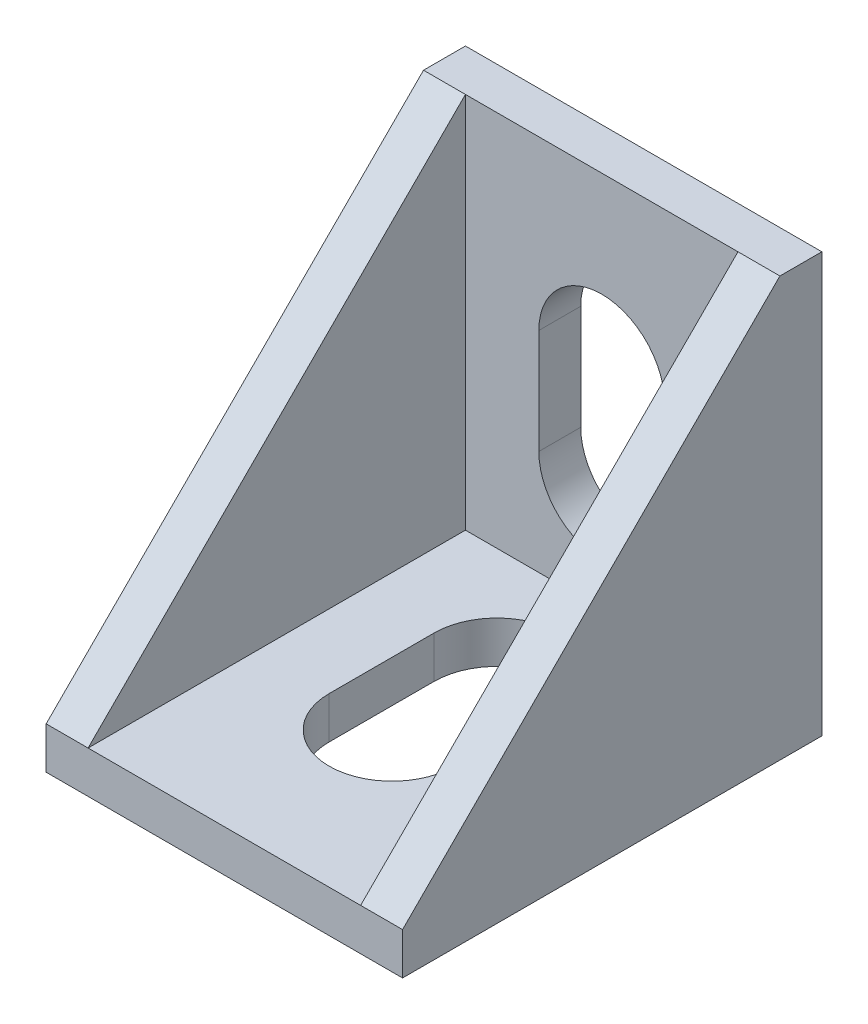
ISO-10303-21;
HEADER;
FILE_DESCRIPTION(('STEP AP214'),'2;1');
FILE_NAME('part.step','',(''),(''),'','','');
FILE_SCHEMA(('AUTOMOTIVE_DESIGN { 1 0 10303 214 1 1 1 1 }'));
ENDSEC;
DATA;
#1=APPLICATION_CONTEXT('core data for automotive mechanical design processes');
#2=APPLICATION_PROTOCOL_DEFINITION('international standard','automotive_design',2000,#1);
#3=PRODUCT_CONTEXT('',#1,'mechanical');
#4=PRODUCT('Part','Part','',(#3));
#5=PRODUCT_RELATED_PRODUCT_CATEGORY('part','',(#4));
#6=PRODUCT_DEFINITION_FORMATION('','',#4);
#7=PRODUCT_DEFINITION_CONTEXT('part definition',#1,'design');
#8=PRODUCT_DEFINITION('design','',#6,#7);
#9=PRODUCT_DEFINITION_SHAPE('','',#8);
#10=(LENGTH_UNIT() NAMED_UNIT(*) SI_UNIT(.MILLI.,.METRE.));
#11=(NAMED_UNIT(*) PLANE_ANGLE_UNIT() SI_UNIT($,.RADIAN.));
#12=(NAMED_UNIT(*) SI_UNIT($,.STERADIAN.) SOLID_ANGLE_UNIT());
#13=UNCERTAINTY_MEASURE_WITH_UNIT(LENGTH_MEASURE(1.E-05),#10,'distance_accuracy_value','');
#14=(GEOMETRIC_REPRESENTATION_CONTEXT(3) GLOBAL_UNCERTAINTY_ASSIGNED_CONTEXT((#13)) GLOBAL_UNIT_ASSIGNED_CONTEXT((#10,
#11,#12)) REPRESENTATION_CONTEXT('',''));
#15=CARTESIAN_POINT('',(0.,0.,0.));
#16=DIRECTION('',(0.,0.,1.));
#17=DIRECTION('',(1.,0.,0.));
#18=AXIS2_PLACEMENT_3D('',#15,#16,#17);
#19=CARTESIAN_POINT('',(0.,0.,0.));
#20=DIRECTION('',(0.,0.,-1.));
#21=DIRECTION('',(-1.,0.,0.));
#22=AXIS2_PLACEMENT_3D('',#19,#20,#21);
#23=PLANE('',#22);
#24=CARTESIAN_POINT('',(-1.,-7.99999999999999,0.));
#25=DIRECTION('',(0.,0.,-1.));
#26=DIRECTION('',(-1.,0.,0.));
#27=AXIS2_PLACEMENT_3D('',#24,#25,#26);
#28=CIRCLE('',#27,1.);
#29=CARTESIAN_POINT('',(-1.,-9.,0.));
#30=VERTEX_POINT('',#29);
#31=CARTESIAN_POINT('',(-1.,-6.99999999999999,0.));
#32=VERTEX_POINT('',#31);
#33=EDGE_CURVE('E39',#30,#32,#28,.T.);
#34=ORIENTED_EDGE('',*,*,#33,.F.);
#35=DIRECTION('',(-1.,0.,0.));
#36=VECTOR('',#35,1.);
#37=CARTESIAN_POINT('',(-1.,-9.,0.));
#38=LINE('',#37,#36);
#39=CARTESIAN_POINT('',(1.,-9.,0.));
#40=VERTEX_POINT('',#39);
#41=EDGE_CURVE('E259',#40,#30,#38,.T.);
#42=ORIENTED_EDGE('',*,*,#41,.F.);
#43=CARTESIAN_POINT('',(1.,-7.99999999999999,0.));
#44=DIRECTION('',(0.,0.,-1.));
#45=DIRECTION('',(-1.,0.,0.));
#46=AXIS2_PLACEMENT_3D('',#43,#44,#45);
#47=CIRCLE('',#46,1.);
#48=CARTESIAN_POINT('',(1.,-6.99999999999999,0.));
#49=VERTEX_POINT('',#48);
#50=EDGE_CURVE('E268',#49,#40,#47,.T.);
#51=ORIENTED_EDGE('',*,*,#50,.F.);
#52=DIRECTION('',(1.,0.,0.));
#53=VECTOR('',#52,1.);
#54=CARTESIAN_POINT('',(-1.,-6.99999999999999,0.));
#55=LINE('',#54,#53);
#56=EDGE_CURVE('E250',#32,#49,#55,.T.);
#57=ORIENTED_EDGE('',*,*,#56,.F.);
#58=EDGE_LOOP('',(#34,#42,#51,#57));
#59=FACE_BOUND('',#58,.T.);
#60=CARTESIAN_POINT('',(0.,-3.,0.));
#61=DIRECTION('',(0.,0.,-1.));
#62=DIRECTION('',(-1.,0.,0.));
#63=AXIS2_PLACEMENT_3D('',#60,#61,#62);
#64=CIRCLE('',#63,3.);
#65=CARTESIAN_POINT('',(-3.,-3.,0.));
#66=VERTEX_POINT('',#65);
#67=CARTESIAN_POINT('',(3.,-3.,0.));
#68=VERTEX_POINT('',#67);
#69=EDGE_CURVE('E355',#66,#68,#64,.F.);
#70=ORIENTED_EDGE('',*,*,#69,.T.);
#71=DIRECTION('',(0.,1.,0.));
#72=VECTOR('',#71,1.);
#73=CARTESIAN_POINT('',(3.,-3.,0.));
#74=LINE('',#73,#72);
#75=CARTESIAN_POINT('',(3.,2.,0.));
#76=VERTEX_POINT('',#75);
#77=EDGE_CURVE('E372',#68,#76,#74,.T.);
#78=ORIENTED_EDGE('',*,*,#77,.T.);
#79=CARTESIAN_POINT('',(0.,2.,0.));
#80=DIRECTION('',(0.,0.,-1.));
#81=DIRECTION('',(-1.,0.,0.));
#82=AXIS2_PLACEMENT_3D('',#79,#80,#81);
#83=CIRCLE('',#82,3.);
#84=CARTESIAN_POINT('',(-3.,2.,0.));
#85=VERTEX_POINT('',#84);
#86=EDGE_CURVE('E349',#76,#85,#83,.F.);
#87=ORIENTED_EDGE('',*,*,#86,.T.);
#88=DIRECTION('',(0.,-1.,0.));
#89=VECTOR('',#88,1.);
#90=CARTESIAN_POINT('',(-3.,-3.,0.));
#91=LINE('',#90,#89);
#92=EDGE_CURVE('E352',#85,#66,#91,.T.);
#93=ORIENTED_EDGE('',*,*,#92,.T.);
#94=EDGE_LOOP('',(#70,#78,#87,#93));
#95=FACE_BOUND('',#94,.T.);
#96=DIRECTION('',(0.,1.,0.));
#97=VECTOR('',#96,1.);
#98=CARTESIAN_POINT('',(8.5,-10.,0.));
#99=LINE('',#98,#97);
#100=CARTESIAN_POINT('',(8.5,-10.,0.));
#101=VERTEX_POINT('',#100);
#102=CARTESIAN_POINT('',(8.5,10.,0.));
#103=VERTEX_POINT('',#102);
#104=EDGE_CURVE('E450',#101,#103,#99,.T.);
#105=ORIENTED_EDGE('',*,*,#104,.F.);
#106=DIRECTION('',(1.,0.,0.));
#107=VECTOR('',#106,1.);
#108=CARTESIAN_POINT('',(-8.5,-10.,0.));
#109=LINE('',#108,#107);
#110=CARTESIAN_POINT('',(-8.5,-10.,0.));
#111=VERTEX_POINT('',#110);
#112=EDGE_CURVE('E457',#111,#101,#109,.T.);
#113=ORIENTED_EDGE('',*,*,#112,.F.);
#114=DIRECTION('',(0.,-1.,0.));
#115=VECTOR('',#114,1.);
#116=CARTESIAN_POINT('',(-8.5,-10.,0.));
#117=LINE('',#116,#115);
#118=CARTESIAN_POINT('',(-8.5,10.,0.));
#119=VERTEX_POINT('',#118);
#120=EDGE_CURVE('E467',#119,#111,#117,.T.);
#121=ORIENTED_EDGE('',*,*,#120,.F.);
#122=DIRECTION('',(-1.,0.,0.));
#123=VECTOR('',#122,1.);
#124=CARTESIAN_POINT('',(-8.5,10.,0.));
#125=LINE('',#124,#123);
#126=EDGE_CURVE('E464',#103,#119,#125,.T.);
#127=ORIENTED_EDGE('',*,*,#126,.F.);
#128=EDGE_LOOP('',(#105,#113,#121,#127));
#129=FACE_BOUND('',#128,.T.);
#130=DIRECTION('',(1.,0.,0.));
#131=VECTOR('',#130,1.);
#132=CARTESIAN_POINT('',(-1.,9.,0.));
#133=LINE('',#132,#131);
#134=CARTESIAN_POINT('',(-1.,9.,0.));
#135=VERTEX_POINT('',#134);
#136=CARTESIAN_POINT('',(1.,9.,0.));
#137=VERTEX_POINT('',#136);
#138=EDGE_CURVE('E898',#135,#137,#133,.T.);
#139=ORIENTED_EDGE('',*,*,#138,.F.);
#140=CARTESIAN_POINT('',(-1.,8.,0.));
#141=DIRECTION('',(0.,0.,-1.));
#142=DIRECTION('',(-1.,0.,0.));
#143=AXIS2_PLACEMENT_3D('',#140,#141,#142);
#144=CIRCLE('',#143,0.999999999999999);
#145=CARTESIAN_POINT('',(-1.,7.,0.));
#146=VERTEX_POINT('',#145);
#147=EDGE_CURVE('E247',#146,#135,#144,.T.);
#148=ORIENTED_EDGE('',*,*,#147,.F.);
#149=DIRECTION('',(-1.,0.,0.));
#150=VECTOR('',#149,1.);
#151=CARTESIAN_POINT('',(-1.,7.,0.));
#152=LINE('',#151,#150);
#153=CARTESIAN_POINT('',(1.,7.,0.));
#154=VERTEX_POINT('',#153);
#155=EDGE_CURVE('E243',#154,#146,#152,.T.);
#156=ORIENTED_EDGE('',*,*,#155,.F.);
#157=CARTESIAN_POINT('',(1.,8.,0.));
#158=DIRECTION('',(0.,0.,-1.));
#159=DIRECTION('',(-1.,0.,0.));
#160=AXIS2_PLACEMENT_3D('',#157,#158,#159);
#161=CIRCLE('',#160,0.999999999999999);
#162=EDGE_CURVE('E895',#137,#154,#161,.T.);
#163=ORIENTED_EDGE('',*,*,#162,.F.);
#164=EDGE_LOOP('',(#139,#148,#156,#163));
#165=FACE_BOUND('',#164,.T.);
#166=ADVANCED_FACE('F16',(#59,#95,#129,#165),#23,.T.);
#167=CARTESIAN_POINT('',(-8.5,-10.,20.));
#168=DIRECTION('',(0.,1.,0.));
#169=DIRECTION('',(0.,0.,1.));
#170=AXIS2_PLACEMENT_3D('',#167,#168,#169);
#171=PLANE('',#170);
#172=CARTESIAN_POINT('',(-1.,-10.,18.));
#173=DIRECTION('',(0.,-1.,0.));
#174=DIRECTION('',(0.,0.,-1.));
#175=AXIS2_PLACEMENT_3D('',#172,#173,#174);
#176=CIRCLE('',#175,1.);
#177=CARTESIAN_POINT('',(-1.,-10.,19.));
#178=VERTEX_POINT('',#177);
#179=CARTESIAN_POINT('',(-1.,-10.,17.));
#180=VERTEX_POINT('',#179);
#181=EDGE_CURVE('E316',#178,#180,#176,.T.);
#182=ORIENTED_EDGE('',*,*,#181,.F.);
#183=DIRECTION('',(-1.,0.,0.));
#184=VECTOR('',#183,1.);
#185=CARTESIAN_POINT('',(-1.,-10.,19.));
#186=LINE('',#185,#184);
#187=CARTESIAN_POINT('',(1.,-10.,19.));
#188=VERTEX_POINT('',#187);
#189=EDGE_CURVE('E321',#188,#178,#186,.T.);
#190=ORIENTED_EDGE('',*,*,#189,.F.);
#191=CARTESIAN_POINT('',(1.,-10.,18.));
#192=DIRECTION('',(0.,-1.,0.));
#193=DIRECTION('',(0.,0.,-1.));
#194=AXIS2_PLACEMENT_3D('',#191,#192,#193);
#195=CIRCLE('',#194,1.);
#196=CARTESIAN_POINT('',(1.,-10.,17.));
#197=VERTEX_POINT('',#196);
#198=EDGE_CURVE('E333',#197,#188,#195,.T.);
#199=ORIENTED_EDGE('',*,*,#198,.F.);
#200=DIRECTION('',(1.,0.,0.));
#201=VECTOR('',#200,1.);
#202=CARTESIAN_POINT('',(-1.,-10.,17.));
#203=LINE('',#202,#201);
#204=EDGE_CURVE('E330',#180,#197,#203,.T.);
#205=ORIENTED_EDGE('',*,*,#204,.F.);
#206=EDGE_LOOP('',(#182,#190,#199,#205));
#207=FACE_BOUND('',#206,.T.);
#208=DIRECTION('',(0.,0.,-1.));
#209=VECTOR('',#208,1.);
#210=CARTESIAN_POINT('',(-3.,-10.,12.));
#211=LINE('',#210,#209);
#212=CARTESIAN_POINT('',(-3.,-10.,12.));
#213=VERTEX_POINT('',#212);
#214=CARTESIAN_POINT('',(-3.,-10.,7.));
#215=VERTEX_POINT('',#214);
#216=EDGE_CURVE('E383',#213,#215,#211,.T.);
#217=ORIENTED_EDGE('',*,*,#216,.F.);
#218=CARTESIAN_POINT('',(0.,-10.,12.));
#219=DIRECTION('',(0.,1.,0.));
#220=DIRECTION('',(0.,0.,1.));
#221=AXIS2_PLACEMENT_3D('',#218,#219,#220);
#222=CIRCLE('',#221,3.);
#223=CARTESIAN_POINT('',(3.,-10.,12.));
#224=VERTEX_POINT('',#223);
#225=EDGE_CURVE('E386',#224,#213,#222,.F.);
#226=ORIENTED_EDGE('',*,*,#225,.F.);
#227=DIRECTION('',(0.,0.,1.));
#228=VECTOR('',#227,1.);
#229=CARTESIAN_POINT('',(3.,-10.,12.));
#230=LINE('',#229,#228);
#231=CARTESIAN_POINT('',(3.,-10.,7.));
#232=VERTEX_POINT('',#231);
#233=EDGE_CURVE('E403',#232,#224,#230,.T.);
#234=ORIENTED_EDGE('',*,*,#233,.F.);
#235=CARTESIAN_POINT('',(0.,-10.,7.));
#236=DIRECTION('',(0.,1.,0.));
#237=DIRECTION('',(0.,0.,1.));
#238=AXIS2_PLACEMENT_3D('',#235,#236,#237);
#239=CIRCLE('',#238,3.);
#240=EDGE_CURVE('E381',#215,#232,#239,.F.);
#241=ORIENTED_EDGE('',*,*,#240,.F.);
#242=EDGE_LOOP('',(#217,#226,#234,#241));
#243=FACE_BOUND('',#242,.T.);
#244=ORIENTED_EDGE('',*,*,#112,.T.);
#245=DIRECTION('',(0.,0.,-1.));
#246=VECTOR('',#245,1.);
#247=CARTESIAN_POINT('',(8.5,-10.,20.));
#248=LINE('',#247,#246);
#249=CARTESIAN_POINT('',(8.5,-10.,20.));
#250=VERTEX_POINT('',#249);
#251=EDGE_CURVE('E461',#250,#101,#248,.T.);
#252=ORIENTED_EDGE('',*,*,#251,.F.);
#253=DIRECTION('',(1.,0.,0.));
#254=VECTOR('',#253,1.);
#255=CARTESIAN_POINT('',(-8.5,-10.,20.));
#256=LINE('',#255,#254);
#257=CARTESIAN_POINT('',(-8.5,-10.,20.));
#258=VERTEX_POINT('',#257);
#259=EDGE_CURVE('E459',#258,#250,#256,.T.);
#260=ORIENTED_EDGE('',*,*,#259,.F.);
#261=DIRECTION('',(0.,0.,-1.));
#262=VECTOR('',#261,1.);
#263=CARTESIAN_POINT('',(-8.5,-10.,20.));
#264=LINE('',#263,#262);
#265=EDGE_CURVE('E472',#258,#111,#264,.T.);
#266=ORIENTED_EDGE('',*,*,#265,.T.);
#267=EDGE_LOOP('',(#244,#252,#260,#266));
#268=FACE_BOUND('',#267,.T.);
#269=CARTESIAN_POINT('',(-0.999999999999998,-10.,2.));
#270=DIRECTION('',(0.,-1.,0.));
#271=DIRECTION('',(0.,0.,-1.));
#272=AXIS2_PLACEMENT_3D('',#269,#270,#271);
#273=CIRCLE('',#272,1.);
#274=CARTESIAN_POINT('',(-0.999999999999998,-10.,3.));
#275=VERTEX_POINT('',#274);
#276=CARTESIAN_POINT('',(-0.999999999999998,-10.,1.));
#277=VERTEX_POINT('',#276);
#278=EDGE_CURVE('E283',#275,#277,#273,.T.);
#279=ORIENTED_EDGE('',*,*,#278,.F.);
#280=DIRECTION('',(-1.,0.,0.));
#281=VECTOR('',#280,1.);
#282=CARTESIAN_POINT('',(-0.999999999999998,-10.,3.));
#283=LINE('',#282,#281);
#284=CARTESIAN_POINT('',(1.,-10.,3.));
#285=VERTEX_POINT('',#284);
#286=EDGE_CURVE('E288',#285,#275,#283,.T.);
#287=ORIENTED_EDGE('',*,*,#286,.F.);
#288=CARTESIAN_POINT('',(1.,-10.,2.));
#289=DIRECTION('',(0.,-1.,0.));
#290=DIRECTION('',(0.,0.,-1.));
#291=AXIS2_PLACEMENT_3D('',#288,#289,#290);
#292=CIRCLE('',#291,1.);
#293=CARTESIAN_POINT('',(1.,-10.,1.));
#294=VERTEX_POINT('',#293);
#295=EDGE_CURVE('E300',#294,#285,#292,.T.);
#296=ORIENTED_EDGE('',*,*,#295,.F.);
#297=DIRECTION('',(1.,0.,0.));
#298=VECTOR('',#297,1.);
#299=CARTESIAN_POINT('',(-0.999999999999998,-10.,1.));
#300=LINE('',#299,#298);
#301=EDGE_CURVE('E297',#277,#294,#300,.T.);
#302=ORIENTED_EDGE('',*,*,#301,.F.);
#303=EDGE_LOOP('',(#279,#287,#296,#302));
#304=FACE_BOUND('',#303,.T.);
#305=ADVANCED_FACE('F491',(#207,#243,#268,#304),#171,.F.);
#306=CARTESIAN_POINT('',(8.5,-10.,20.));
#307=DIRECTION('',(-1.,0.,0.));
#308=DIRECTION('',(0.,0.,1.));
#309=AXIS2_PLACEMENT_3D('',#306,#307,#308);
#310=PLANE('',#309);
#311=DIRECTION('',(0.,0.,-1.));
#312=VECTOR('',#311,1.);
#313=CARTESIAN_POINT('',(8.5,10.,20.));
#314=LINE('',#313,#312);
#315=CARTESIAN_POINT('',(8.5,10.,2.));
#316=VERTEX_POINT('',#315);
#317=EDGE_CURVE('E11',#316,#103,#314,.T.);
#318=ORIENTED_EDGE('',*,*,#317,.F.);
#319=DIRECTION('',(0.,-0.707106781186548,0.707106781186548));
#320=VECTOR('',#319,1.);
#321=CARTESIAN_POINT('',(8.5,-9.,21.));
#322=LINE('',#321,#320);
#323=CARTESIAN_POINT('',(8.5,-8.,20.));
#324=VERTEX_POINT('',#323);
#325=EDGE_CURVE('E428',#316,#324,#322,.T.);
#326=ORIENTED_EDGE('',*,*,#325,.T.);
#327=DIRECTION('',(0.,1.,0.));
#328=VECTOR('',#327,1.);
#329=CARTESIAN_POINT('',(8.5,-10.,20.));
#330=LINE('',#329,#328);
#331=EDGE_CURVE('E453',#250,#324,#330,.T.);
#332=ORIENTED_EDGE('',*,*,#331,.F.);
#333=ORIENTED_EDGE('',*,*,#251,.T.);
#334=ORIENTED_EDGE('',*,*,#104,.T.);
#335=EDGE_LOOP('',(#318,#326,#332,#333,#334));
#336=FACE_BOUND('',#335,.T.);
#337=ADVANCED_FACE('F18',(#336),#310,.F.);
#338=CARTESIAN_POINT('',(-8.5,10.,20.));
#339=DIRECTION('',(0.,-1.,0.));
#340=DIRECTION('',(0.,0.,-1.));
#341=AXIS2_PLACEMENT_3D('',#338,#339,#340);
#342=PLANE('',#341);
#343=DIRECTION('',(0.,0.,-1.));
#344=VECTOR('',#343,1.);
#345=CARTESIAN_POINT('',(-8.5,10.,20.));
#346=LINE('',#345,#344);
#347=CARTESIAN_POINT('',(-8.5,10.,2.));
#348=VERTEX_POINT('',#347);
#349=EDGE_CURVE('E24',#348,#119,#346,.T.);
#350=ORIENTED_EDGE('',*,*,#349,.F.);
#351=DIRECTION('',(1.,0.,0.));
#352=VECTOR('',#351,1.);
#353=CARTESIAN_POINT('',(-8.5,10.,2.));
#354=LINE('',#353,#352);
#355=CARTESIAN_POINT('',(-6.5,10.,2.));
#356=VERTEX_POINT('',#355);
#357=EDGE_CURVE('E416',#348,#356,#354,.T.);
#358=ORIENTED_EDGE('',*,*,#357,.T.);
#359=DIRECTION('',(-1.,0.,0.));
#360=VECTOR('',#359,1.);
#361=CARTESIAN_POINT('',(-6.5,10.,2.));
#362=LINE('',#361,#360);
#363=CARTESIAN_POINT('',(6.5,10.,2.));
#364=VERTEX_POINT('',#363);
#365=EDGE_CURVE('E431',#364,#356,#362,.T.);
#366=ORIENTED_EDGE('',*,*,#365,.F.);
#367=EDGE_CURVE('E420',#364,#316,#354,.T.);
#368=ORIENTED_EDGE('',*,*,#367,.T.);
#369=ORIENTED_EDGE('',*,*,#317,.T.);
#370=ORIENTED_EDGE('',*,*,#126,.T.);
#371=EDGE_LOOP('',(#350,#358,#366,#368,#369,#370));
#372=FACE_BOUND('',#371,.T.);
#373=ADVANCED_FACE('F482',(#372),#342,.F.);
#374=CARTESIAN_POINT('',(-8.5,-10.,20.));
#375=DIRECTION('',(1.,0.,0.));
#376=DIRECTION('',(0.,0.,-1.));
#377=AXIS2_PLACEMENT_3D('',#374,#375,#376);
#378=PLANE('',#377);
#379=DIRECTION('',(0.,-1.,0.));
#380=VECTOR('',#379,1.);
#381=CARTESIAN_POINT('',(-8.5,-10.,20.));
#382=LINE('',#381,#380);
#383=CARTESIAN_POINT('',(-8.5,-8.,20.));
#384=VERTEX_POINT('',#383);
#385=EDGE_CURVE('E456',#384,#258,#382,.T.);
#386=ORIENTED_EDGE('',*,*,#385,.F.);
#387=DIRECTION('',(0.,0.707106781186547,-0.707106781186547));
#388=VECTOR('',#387,1.);
#389=CARTESIAN_POINT('',(-8.5,10.,2.));
#390=LINE('',#389,#388);
#391=EDGE_CURVE('E412',#384,#348,#390,.T.);
#392=ORIENTED_EDGE('',*,*,#391,.T.);
#393=ORIENTED_EDGE('',*,*,#349,.T.);
#394=ORIENTED_EDGE('',*,*,#120,.T.);
#395=ORIENTED_EDGE('',*,*,#265,.F.);
#396=EDGE_LOOP('',(#386,#392,#393,#394,#395));
#397=FACE_BOUND('',#396,.T.);
#398=ADVANCED_FACE('F477',(#397),#378,.F.);
#399=CARTESIAN_POINT('',(0.,0.,20.));
#400=DIRECTION('',(0.,0.,-1.));
#401=DIRECTION('',(-1.,0.,0.));
#402=AXIS2_PLACEMENT_3D('',#399,#400,#401);
#403=PLANE('',#402);
#404=ORIENTED_EDGE('',*,*,#331,.T.);
#405=DIRECTION('',(1.,0.,0.));
#406=VECTOR('',#405,1.);
#407=CARTESIAN_POINT('',(-8.5,-8.,20.));
#408=LINE('',#407,#406);
#409=CARTESIAN_POINT('',(6.5,-8.,20.));
#410=VERTEX_POINT('',#409);
#411=EDGE_CURVE('E415',#410,#324,#408,.T.);
#412=ORIENTED_EDGE('',*,*,#411,.F.);
#413=DIRECTION('',(1.,0.,0.));
#414=VECTOR('',#413,1.);
#415=CARTESIAN_POINT('',(-6.5,-8.,20.));
#416=LINE('',#415,#414);
#417=CARTESIAN_POINT('',(-6.5,-8.,20.));
#418=VERTEX_POINT('',#417);
#419=EDGE_CURVE('E435',#418,#410,#416,.T.);
#420=ORIENTED_EDGE('',*,*,#419,.F.);
#421=EDGE_CURVE('E421',#384,#418,#408,.T.);
#422=ORIENTED_EDGE('',*,*,#421,.F.);
#423=ORIENTED_EDGE('',*,*,#385,.T.);
#424=ORIENTED_EDGE('',*,*,#259,.T.);
#425=EDGE_LOOP('',(#404,#412,#420,#422,#423,#424));
#426=FACE_BOUND('',#425,.T.);
#427=ADVANCED_FACE('F498',(#426),#403,.F.);
#428=CARTESIAN_POINT('',(-6.5,-8.,20.));
#429=DIRECTION('',(-1.,0.,0.));
#430=DIRECTION('',(0.,0.,1.));
#431=AXIS2_PLACEMENT_3D('',#428,#429,#430);
#432=PLANE('',#431);
#433=DIRECTION('',(0.,1.,0.));
#434=VECTOR('',#433,1.);
#435=CARTESIAN_POINT('',(-6.5,-8.,2.));
#436=LINE('',#435,#434);
#437=CARTESIAN_POINT('',(-6.5,-8.,2.));
#438=VERTEX_POINT('',#437);
#439=EDGE_CURVE('E447',#438,#356,#436,.T.);
#440=ORIENTED_EDGE('',*,*,#439,.T.);
#441=DIRECTION('',(0.,-0.707106781186548,0.707106781186548));
#442=VECTOR('',#441,1.);
#443=CARTESIAN_POINT('',(-6.5,-8.,20.));
#444=LINE('',#443,#442);
#445=EDGE_CURVE('E425',#356,#418,#444,.T.);
#446=ORIENTED_EDGE('',*,*,#445,.T.);
#447=DIRECTION('',(0.,0.,1.));
#448=VECTOR('',#447,1.);
#449=CARTESIAN_POINT('',(-6.5,-8.,20.));
#450=LINE('',#449,#448);
#451=EDGE_CURVE('E432',#438,#418,#450,.T.);
#452=ORIENTED_EDGE('',*,*,#451,.F.);
#453=EDGE_LOOP('',(#440,#446,#452));
#454=FACE_BOUND('',#453,.T.);
#455=ADVANCED_FACE('F506',(#454),#432,.F.);
#456=CARTESIAN_POINT('',(-6.5,-8.,2.));
#457=DIRECTION('',(0.,0.,-1.));
#458=DIRECTION('',(-1.,0.,0.));
#459=AXIS2_PLACEMENT_3D('',#456,#457,#458);
#460=PLANE('',#459);
#461=DIRECTION('',(0.,1.,0.));
#462=VECTOR('',#461,1.);
#463=CARTESIAN_POINT('',(3.,-3.,2.));
#464=LINE('',#463,#462);
#465=CARTESIAN_POINT('',(3.,-3.,2.));
#466=VERTEX_POINT('',#465);
#467=CARTESIAN_POINT('',(3.,2.,2.));
#468=VERTEX_POINT('',#467);
#469=EDGE_CURVE('E360',#466,#468,#464,.T.);
#470=ORIENTED_EDGE('',*,*,#469,.F.);
#471=CARTESIAN_POINT('',(0.,-3.,2.));
#472=DIRECTION('',(0.,0.,1.));
#473=DIRECTION('',(1.,0.,0.));
#474=AXIS2_PLACEMENT_3D('',#471,#472,#473);
#475=CIRCLE('',#474,3.);
#476=CARTESIAN_POINT('',(-3.,-3.,2.));
#477=VERTEX_POINT('',#476);
#478=EDGE_CURVE('E358',#477,#466,#475,.T.);
#479=ORIENTED_EDGE('',*,*,#478,.F.);
#480=DIRECTION('',(0.,-1.,0.));
#481=VECTOR('',#480,1.);
#482=CARTESIAN_POINT('',(-3.,-3.,2.));
#483=LINE('',#482,#481);
#484=CARTESIAN_POINT('',(-3.,2.,2.));
#485=VERTEX_POINT('',#484);
#486=EDGE_CURVE('E366',#485,#477,#483,.T.);
#487=ORIENTED_EDGE('',*,*,#486,.F.);
#488=CARTESIAN_POINT('',(0.,2.,2.));
#489=DIRECTION('',(0.,0.,1.));
#490=DIRECTION('',(1.,0.,0.));
#491=AXIS2_PLACEMENT_3D('',#488,#489,#490);
#492=CIRCLE('',#491,3.);
#493=EDGE_CURVE('E363',#468,#485,#492,.T.);
#494=ORIENTED_EDGE('',*,*,#493,.F.);
#495=EDGE_LOOP('',(#470,#479,#487,#494));
#496=FACE_BOUND('',#495,.T.);
#497=ORIENTED_EDGE('',*,*,#365,.T.);
#498=ORIENTED_EDGE('',*,*,#439,.F.);
#499=DIRECTION('',(-1.,0.,0.));
#500=VECTOR('',#499,1.);
#501=CARTESIAN_POINT('',(-6.5,-8.,2.));
#502=LINE('',#501,#500);
#503=CARTESIAN_POINT('',(6.5,-8.,2.));
#504=VERTEX_POINT('',#503);
#505=EDGE_CURVE('E441',#504,#438,#502,.T.);
#506=ORIENTED_EDGE('',*,*,#505,.F.);
#507=DIRECTION('',(0.,1.,0.));
#508=VECTOR('',#507,1.);
#509=CARTESIAN_POINT('',(6.5,-8.,2.));
#510=LINE('',#509,#508);
#511=EDGE_CURVE('E444',#504,#364,#510,.T.);
#512=ORIENTED_EDGE('',*,*,#511,.T.);
#513=EDGE_LOOP('',(#497,#498,#506,#512));
#514=FACE_BOUND('',#513,.T.);
#515=ADVANCED_FACE('F511',(#496,#514),#460,.F.);
#516=CARTESIAN_POINT('',(6.5,-8.,20.));
#517=DIRECTION('',(1.,0.,0.));
#518=DIRECTION('',(0.,0.,-1.));
#519=AXIS2_PLACEMENT_3D('',#516,#517,#518);
#520=PLANE('',#519);
#521=DIRECTION('',(0.,0.,-1.));
#522=VECTOR('',#521,1.);
#523=CARTESIAN_POINT('',(6.5,-8.,20.));
#524=LINE('',#523,#522);
#525=EDGE_CURVE('E438',#410,#504,#524,.T.);
#526=ORIENTED_EDGE('',*,*,#525,.F.);
#527=DIRECTION('',(0.,0.707106781186548,-0.707106781186548));
#528=VECTOR('',#527,1.);
#529=CARTESIAN_POINT('',(6.5,-8.,20.));
#530=LINE('',#529,#528);
#531=EDGE_CURVE('E419',#410,#364,#530,.T.);
#532=ORIENTED_EDGE('',*,*,#531,.T.);
#533=ORIENTED_EDGE('',*,*,#511,.F.);
#534=EDGE_LOOP('',(#526,#532,#533));
#535=FACE_BOUND('',#534,.T.);
#536=ADVANCED_FACE('F516',(#535),#520,.F.);
#537=CARTESIAN_POINT('',(0.,-8.,0.));
#538=DIRECTION('',(0.,-1.,0.));
#539=DIRECTION('',(0.,0.,-1.));
#540=AXIS2_PLACEMENT_3D('',#537,#538,#539);
#541=PLANE('',#540);
#542=DIRECTION('',(0.,0.,-1.));
#543=VECTOR('',#542,1.);
#544=CARTESIAN_POINT('',(3.,-8.,12.));
#545=LINE('',#544,#543);
#546=CARTESIAN_POINT('',(3.,-8.,12.));
#547=VERTEX_POINT('',#546);
#548=CARTESIAN_POINT('',(3.,-8.,7.));
#549=VERTEX_POINT('',#548);
#550=EDGE_CURVE('E391',#547,#549,#545,.T.);
#551=ORIENTED_EDGE('',*,*,#550,.F.);
#552=CARTESIAN_POINT('',(0.,-8.,12.));
#553=DIRECTION('',(0.,1.,0.));
#554=DIRECTION('',(0.,0.,1.));
#555=AXIS2_PLACEMENT_3D('',#552,#553,#554);
#556=CIRCLE('',#555,3.);
#557=CARTESIAN_POINT('',(-3.,-8.,12.));
#558=VERTEX_POINT('',#557);
#559=EDGE_CURVE('E389',#558,#547,#556,.T.);
#560=ORIENTED_EDGE('',*,*,#559,.F.);
#561=DIRECTION('',(0.,0.,1.));
#562=VECTOR('',#561,1.);
#563=CARTESIAN_POINT('',(-3.,-8.,12.));
#564=LINE('',#563,#562);
#565=CARTESIAN_POINT('',(-3.,-8.,7.));
#566=VERTEX_POINT('',#565);
#567=EDGE_CURVE('E397',#566,#558,#564,.T.);
#568=ORIENTED_EDGE('',*,*,#567,.F.);
#569=CARTESIAN_POINT('',(0.,-8.,7.));
#570=DIRECTION('',(0.,1.,0.));
#571=DIRECTION('',(0.,0.,1.));
#572=AXIS2_PLACEMENT_3D('',#569,#570,#571);
#573=CIRCLE('',#572,3.);
#574=EDGE_CURVE('E394',#549,#566,#573,.T.);
#575=ORIENTED_EDGE('',*,*,#574,.F.);
#576=EDGE_LOOP('',(#551,#560,#568,#575));
#577=FACE_BOUND('',#576,.T.);
#578=ORIENTED_EDGE('',*,*,#451,.T.);
#579=ORIENTED_EDGE('',*,*,#419,.T.);
#580=ORIENTED_EDGE('',*,*,#525,.T.);
#581=ORIENTED_EDGE('',*,*,#505,.T.);
#582=EDGE_LOOP('',(#578,#579,#580,#581));
#583=FACE_BOUND('',#582,.T.);
#584=ADVANCED_FACE('F508',(#577,#583),#541,.F.);
#585=CARTESIAN_POINT('',(-8.5,10.,2.));
#586=DIRECTION('',(0.,-0.707106781186548,-0.707106781186548));
#587=DIRECTION('',(0.,0.707106781186548,-0.707106781186548));
#588=AXIS2_PLACEMENT_3D('',#585,#586,#587);
#589=PLANE('',#588);
#590=ORIENTED_EDGE('',*,*,#367,.F.);
#591=ORIENTED_EDGE('',*,*,#531,.F.);
#592=ORIENTED_EDGE('',*,*,#411,.T.);
#593=ORIENTED_EDGE('',*,*,#325,.F.);
#594=EDGE_LOOP('',(#590,#591,#592,#593));
#595=FACE_BOUND('',#594,.T.);
#596=ADVANCED_FACE('F514',(#595),#589,.F.);
#597=ORIENTED_EDGE('',*,*,#357,.F.);
#598=ORIENTED_EDGE('',*,*,#391,.F.);
#599=ORIENTED_EDGE('',*,*,#421,.T.);
#600=ORIENTED_EDGE('',*,*,#445,.F.);
#601=EDGE_LOOP('',(#597,#598,#599,#600));
#602=FACE_BOUND('',#601,.T.);
#603=ADVANCED_FACE('F503',(#602),#589,.F.);
#604=CARTESIAN_POINT('',(0.,-10.001,12.));
#605=DIRECTION('',(0.,1.,0.));
#606=DIRECTION('',(0.,0.,1.));
#607=AXIS2_PLACEMENT_3D('',#604,#605,#606);
#608=CYLINDRICAL_SURFACE('',#607,3.);
#609=ORIENTED_EDGE('',*,*,#225,.T.);
#610=DIRECTION('',(0.,1.,0.));
#611=VECTOR('',#610,1.);
#612=CARTESIAN_POINT('',(-3.,-10.001,12.));
#613=LINE('',#612,#611);
#614=EDGE_CURVE('E401',#213,#558,#613,.T.);
#615=ORIENTED_EDGE('',*,*,#614,.T.);
#616=ORIENTED_EDGE('',*,*,#559,.T.);
#617=DIRECTION('',(0.,1.,0.));
#618=VECTOR('',#617,1.);
#619=CARTESIAN_POINT('',(3.,-10.001,12.));
#620=LINE('',#619,#618);
#621=EDGE_CURVE('E400',#224,#547,#620,.T.);
#622=ORIENTED_EDGE('',*,*,#621,.F.);
#623=EDGE_LOOP('',(#609,#615,#616,#622));
#624=FACE_BOUND('',#623,.T.);
#625=ADVANCED_FACE('F618',(#624),#608,.F.);
#626=CARTESIAN_POINT('',(-3.,-10.001,12.));
#627=DIRECTION('',(-1.,0.,0.));
#628=DIRECTION('',(0.,0.,1.));
#629=AXIS2_PLACEMENT_3D('',#626,#627,#628);
#630=PLANE('',#629);
#631=ORIENTED_EDGE('',*,*,#216,.T.);
#632=DIRECTION('',(0.,1.,0.));
#633=VECTOR('',#632,1.);
#634=CARTESIAN_POINT('',(-3.,-10.001,7.));
#635=LINE('',#634,#633);
#636=EDGE_CURVE('E404',#215,#566,#635,.T.);
#637=ORIENTED_EDGE('',*,*,#636,.T.);
#638=ORIENTED_EDGE('',*,*,#567,.T.);
#639=ORIENTED_EDGE('',*,*,#614,.F.);
#640=EDGE_LOOP('',(#631,#637,#638,#639));
#641=FACE_BOUND('',#640,.T.);
#642=ADVANCED_FACE('F624',(#641),#630,.F.);
#643=CARTESIAN_POINT('',(0.,-10.001,7.));
#644=DIRECTION('',(0.,1.,0.));
#645=DIRECTION('',(0.,0.,1.));
#646=AXIS2_PLACEMENT_3D('',#643,#644,#645);
#647=CYLINDRICAL_SURFACE('',#646,3.);
#648=ORIENTED_EDGE('',*,*,#240,.T.);
#649=DIRECTION('',(0.,1.,0.));
#650=VECTOR('',#649,1.);
#651=CARTESIAN_POINT('',(3.,-10.001,7.));
#652=LINE('',#651,#650);
#653=EDGE_CURVE('E406',#232,#549,#652,.T.);
#654=ORIENTED_EDGE('',*,*,#653,.T.);
#655=ORIENTED_EDGE('',*,*,#574,.T.);
#656=ORIENTED_EDGE('',*,*,#636,.F.);
#657=EDGE_LOOP('',(#648,#654,#655,#656));
#658=FACE_BOUND('',#657,.T.);
#659=ADVANCED_FACE('F634',(#658),#647,.F.);
#660=CARTESIAN_POINT('',(3.,-10.001,12.));
#661=DIRECTION('',(1.,0.,0.));
#662=DIRECTION('',(0.,0.,-1.));
#663=AXIS2_PLACEMENT_3D('',#660,#661,#662);
#664=PLANE('',#663);
#665=ORIENTED_EDGE('',*,*,#233,.T.);
#666=ORIENTED_EDGE('',*,*,#621,.T.);
#667=ORIENTED_EDGE('',*,*,#550,.T.);
#668=ORIENTED_EDGE('',*,*,#653,.F.);
#669=EDGE_LOOP('',(#665,#666,#667,#668));
#670=FACE_BOUND('',#669,.T.);
#671=ADVANCED_FACE('F644',(#670),#664,.F.);
#672=CARTESIAN_POINT('',(0.,-3.,-0.00100000000000013));
#673=DIRECTION('',(0.,0.,1.));
#674=DIRECTION('',(1.,0.,0.));
#675=AXIS2_PLACEMENT_3D('',#672,#673,#674);
#676=CYLINDRICAL_SURFACE('',#675,3.);
#677=DIRECTION('',(0.,0.,1.));
#678=VECTOR('',#677,1.);
#679=CARTESIAN_POINT('',(-3.,-3.,-0.00100000000000013));
#680=LINE('',#679,#678);
#681=EDGE_CURVE('E370',#66,#477,#680,.T.);
#682=ORIENTED_EDGE('',*,*,#681,.T.);
#683=ORIENTED_EDGE('',*,*,#478,.T.);
#684=DIRECTION('',(0.,0.,1.));
#685=VECTOR('',#684,1.);
#686=CARTESIAN_POINT('',(3.,-3.,-0.00100000000000013));
#687=LINE('',#686,#685);
#688=EDGE_CURVE('E369',#68,#466,#687,.T.);
#689=ORIENTED_EDGE('',*,*,#688,.F.);
#690=ORIENTED_EDGE('',*,*,#69,.F.);
#691=EDGE_LOOP('',(#682,#683,#689,#690));
#692=FACE_BOUND('',#691,.T.);
#693=ADVANCED_FACE('F652',(#692),#676,.F.);
#694=CARTESIAN_POINT('',(-3.,-3.,-0.00100000000000013));
#695=DIRECTION('',(-1.,0.,0.));
#696=DIRECTION('',(0.,0.,1.));
#697=AXIS2_PLACEMENT_3D('',#694,#695,#696);
#698=PLANE('',#697);
#699=DIRECTION('',(0.,0.,1.));
#700=VECTOR('',#699,1.);
#701=CARTESIAN_POINT('',(-3.,2.,-0.00100000000000013));
#702=LINE('',#701,#700);
#703=EDGE_CURVE('E373',#85,#485,#702,.T.);
#704=ORIENTED_EDGE('',*,*,#703,.T.);
#705=ORIENTED_EDGE('',*,*,#486,.T.);
#706=ORIENTED_EDGE('',*,*,#681,.F.);
#707=ORIENTED_EDGE('',*,*,#92,.F.);
#708=EDGE_LOOP('',(#704,#705,#706,#707));
#709=FACE_BOUND('',#708,.T.);
#710=ADVANCED_FACE('F660',(#709),#698,.F.);
#711=CARTESIAN_POINT('',(0.,2.,-0.00100000000000013));
#712=DIRECTION('',(0.,0.,1.));
#713=DIRECTION('',(1.,0.,0.));
#714=AXIS2_PLACEMENT_3D('',#711,#712,#713);
#715=CYLINDRICAL_SURFACE('',#714,3.);
#716=DIRECTION('',(0.,0.,1.));
#717=VECTOR('',#716,1.);
#718=CARTESIAN_POINT('',(3.,2.,-0.00100000000000013));
#719=LINE('',#718,#717);
#720=EDGE_CURVE('E375',#76,#468,#719,.T.);
#721=ORIENTED_EDGE('',*,*,#720,.T.);
#722=ORIENTED_EDGE('',*,*,#493,.T.);
#723=ORIENTED_EDGE('',*,*,#703,.F.);
#724=ORIENTED_EDGE('',*,*,#86,.F.);
#725=EDGE_LOOP('',(#721,#722,#723,#724));
#726=FACE_BOUND('',#725,.T.);
#727=ADVANCED_FACE('F670',(#726),#715,.F.);
#728=CARTESIAN_POINT('',(3.,-3.,-0.00100000000000013));
#729=DIRECTION('',(1.,0.,0.));
#730=DIRECTION('',(0.,0.,-1.));
#731=AXIS2_PLACEMENT_3D('',#728,#729,#730);
#732=PLANE('',#731);
#733=ORIENTED_EDGE('',*,*,#688,.T.);
#734=ORIENTED_EDGE('',*,*,#469,.T.);
#735=ORIENTED_EDGE('',*,*,#720,.F.);
#736=ORIENTED_EDGE('',*,*,#77,.F.);
#737=EDGE_LOOP('',(#733,#734,#735,#736));
#738=FACE_BOUND('',#737,.T.);
#739=ADVANCED_FACE('F680',(#738),#732,.F.);
#740=CARTESIAN_POINT('',(-1.,-11.,18.));
#741=DIRECTION('',(0.,1.,0.));
#742=DIRECTION('',(0.,0.,1.));
#743=AXIS2_PLACEMENT_3D('',#740,#741,#742);
#744=CYLINDRICAL_SURFACE('',#743,1.);
#745=ORIENTED_EDGE('',*,*,#181,.T.);
#746=DIRECTION('',(0.,1.,0.));
#747=VECTOR('',#746,1.);
#748=CARTESIAN_POINT('',(-1.,-11.,17.));
#749=LINE('',#748,#747);
#750=CARTESIAN_POINT('',(-1.,-11.,17.));
#751=VERTEX_POINT('',#750);
#752=EDGE_CURVE('E346',#751,#180,#749,.T.);
#753=ORIENTED_EDGE('',*,*,#752,.F.);
#754=CARTESIAN_POINT('',(-1.,-11.,18.));
#755=DIRECTION('',(0.,-1.,0.));
#756=DIRECTION('',(0.,0.,-1.));
#757=AXIS2_PLACEMENT_3D('',#754,#755,#756);
#758=CIRCLE('',#757,1.);
#759=CARTESIAN_POINT('',(-1.,-11.,19.));
#760=VERTEX_POINT('',#759);
#761=EDGE_CURVE('E317',#760,#751,#758,.T.);
#762=ORIENTED_EDGE('',*,*,#761,.F.);
#763=DIRECTION('',(0.,1.,0.));
#764=VECTOR('',#763,1.);
#765=CARTESIAN_POINT('',(-1.,-11.,19.));
#766=LINE('',#765,#764);
#767=EDGE_CURVE('E327',#760,#178,#766,.T.);
#768=ORIENTED_EDGE('',*,*,#767,.T.);
#769=EDGE_LOOP('',(#745,#753,#762,#768));
#770=FACE_BOUND('',#769,.T.);
#771=ADVANCED_FACE('F688',(#770),#744,.T.);
#772=CARTESIAN_POINT('',(-1.,-11.,17.));
#773=DIRECTION('',(0.,0.,1.));
#774=DIRECTION('',(1.,0.,0.));
#775=AXIS2_PLACEMENT_3D('',#772,#773,#774);
#776=PLANE('',#775);
#777=ORIENTED_EDGE('',*,*,#204,.T.);
#778=DIRECTION('',(0.,1.,0.));
#779=VECTOR('',#778,1.);
#780=CARTESIAN_POINT('',(1.,-11.,17.));
#781=LINE('',#780,#779);
#782=CARTESIAN_POINT('',(1.,-11.,17.));
#783=VERTEX_POINT('',#782);
#784=EDGE_CURVE('E343',#783,#197,#781,.T.);
#785=ORIENTED_EDGE('',*,*,#784,.F.);
#786=DIRECTION('',(1.,0.,0.));
#787=VECTOR('',#786,1.);
#788=CARTESIAN_POINT('',(-1.,-11.,17.));
#789=LINE('',#788,#787);
#790=EDGE_CURVE('E320',#751,#783,#789,.T.);
#791=ORIENTED_EDGE('',*,*,#790,.F.);
#792=ORIENTED_EDGE('',*,*,#752,.T.);
#793=EDGE_LOOP('',(#777,#785,#791,#792));
#794=FACE_BOUND('',#793,.T.);
#795=ADVANCED_FACE('F696',(#794),#776,.F.);
#796=CARTESIAN_POINT('',(1.,-11.,18.));
#797=DIRECTION('',(0.,1.,0.));
#798=DIRECTION('',(0.,0.,1.));
#799=AXIS2_PLACEMENT_3D('',#796,#797,#798);
#800=CYLINDRICAL_SURFACE('',#799,1.);
#801=ORIENTED_EDGE('',*,*,#198,.T.);
#802=DIRECTION('',(0.,1.,0.));
#803=VECTOR('',#802,1.);
#804=CARTESIAN_POINT('',(1.,-11.,19.));
#805=LINE('',#804,#803);
#806=CARTESIAN_POINT('',(1.,-11.,19.));
#807=VERTEX_POINT('',#806);
#808=EDGE_CURVE('E340',#807,#188,#805,.T.);
#809=ORIENTED_EDGE('',*,*,#808,.F.);
#810=CARTESIAN_POINT('',(1.,-11.,18.));
#811=DIRECTION('',(0.,-1.,0.));
#812=DIRECTION('',(0.,0.,-1.));
#813=AXIS2_PLACEMENT_3D('',#810,#811,#812);
#814=CIRCLE('',#813,1.);
#815=EDGE_CURVE('E323',#783,#807,#814,.T.);
#816=ORIENTED_EDGE('',*,*,#815,.F.);
#817=ORIENTED_EDGE('',*,*,#784,.T.);
#818=EDGE_LOOP('',(#801,#809,#816,#817));
#819=FACE_BOUND('',#818,.T.);
#820=ADVANCED_FACE('F705',(#819),#800,.T.);
#821=CARTESIAN_POINT('',(-1.,-11.,19.));
#822=DIRECTION('',(0.,0.,-1.));
#823=DIRECTION('',(-1.,0.,0.));
#824=AXIS2_PLACEMENT_3D('',#821,#822,#823);
#825=PLANE('',#824);
#826=ORIENTED_EDGE('',*,*,#189,.T.);
#827=ORIENTED_EDGE('',*,*,#767,.F.);
#828=DIRECTION('',(-1.,0.,0.));
#829=VECTOR('',#828,1.);
#830=CARTESIAN_POINT('',(-1.,-11.,19.));
#831=LINE('',#830,#829);
#832=EDGE_CURVE('E325',#807,#760,#831,.T.);
#833=ORIENTED_EDGE('',*,*,#832,.F.);
#834=ORIENTED_EDGE('',*,*,#808,.T.);
#835=EDGE_LOOP('',(#826,#827,#833,#834));
#836=FACE_BOUND('',#835,.T.);
#837=ADVANCED_FACE('F714',(#836),#825,.F.);
#838=CARTESIAN_POINT('',(-1.,-11.,18.));
#839=DIRECTION('',(0.,-1.,0.));
#840=DIRECTION('',(0.,0.,-1.));
#841=AXIS2_PLACEMENT_3D('',#838,#839,#840);
#842=PLANE('',#841);
#843=ORIENTED_EDGE('',*,*,#761,.T.);
#844=ORIENTED_EDGE('',*,*,#790,.T.);
#845=ORIENTED_EDGE('',*,*,#815,.T.);
#846=ORIENTED_EDGE('',*,*,#832,.T.);
#847=EDGE_LOOP('',(#843,#844,#845,#846));
#848=FACE_BOUND('',#847,.T.);
#849=ADVANCED_FACE('F723',(#848),#842,.T.);
#850=CARTESIAN_POINT('',(-0.999999999999998,-11.,2.));
#851=DIRECTION('',(0.,1.,0.));
#852=DIRECTION('',(0.,0.,1.));
#853=AXIS2_PLACEMENT_3D('',#850,#851,#852);
#854=CYLINDRICAL_SURFACE('',#853,1.);
#855=ORIENTED_EDGE('',*,*,#278,.T.);
#856=DIRECTION('',(0.,1.,0.));
#857=VECTOR('',#856,1.);
#858=CARTESIAN_POINT('',(-0.999999999999998,-11.,1.));
#859=LINE('',#858,#857);
#860=CARTESIAN_POINT('',(-0.999999999999998,-11.,1.));
#861=VERTEX_POINT('',#860);
#862=EDGE_CURVE('E313',#861,#277,#859,.T.);
#863=ORIENTED_EDGE('',*,*,#862,.F.);
#864=CARTESIAN_POINT('',(-0.999999999999998,-11.,2.));
#865=DIRECTION('',(0.,-1.,0.));
#866=DIRECTION('',(0.,0.,-1.));
#867=AXIS2_PLACEMENT_3D('',#864,#865,#866);
#868=CIRCLE('',#867,1.);
#869=CARTESIAN_POINT('',(-0.999999999999998,-11.,3.));
#870=VERTEX_POINT('',#869);
#871=EDGE_CURVE('E284',#870,#861,#868,.T.);
#872=ORIENTED_EDGE('',*,*,#871,.F.);
#873=DIRECTION('',(0.,1.,0.));
#874=VECTOR('',#873,1.);
#875=CARTESIAN_POINT('',(-0.999999999999998,-11.,3.));
#876=LINE('',#875,#874);
#877=EDGE_CURVE('E294',#870,#275,#876,.T.);
#878=ORIENTED_EDGE('',*,*,#877,.T.);
#879=EDGE_LOOP('',(#855,#863,#872,#878));
#880=FACE_BOUND('',#879,.T.);
#881=ADVANCED_FACE('F732',(#880),#854,.T.);
#882=CARTESIAN_POINT('',(-0.999999999999998,-11.,1.));
#883=DIRECTION('',(0.,0.,1.));
#884=DIRECTION('',(1.,0.,0.));
#885=AXIS2_PLACEMENT_3D('',#882,#883,#884);
#886=PLANE('',#885);
#887=ORIENTED_EDGE('',*,*,#301,.T.);
#888=DIRECTION('',(0.,1.,0.));
#889=VECTOR('',#888,1.);
#890=CARTESIAN_POINT('',(1.,-11.,1.));
#891=LINE('',#890,#889);
#892=CARTESIAN_POINT('',(1.,-11.,1.));
#893=VERTEX_POINT('',#892);
#894=EDGE_CURVE('E310',#893,#294,#891,.T.);
#895=ORIENTED_EDGE('',*,*,#894,.F.);
#896=DIRECTION('',(1.,0.,0.));
#897=VECTOR('',#896,1.);
#898=CARTESIAN_POINT('',(-0.999999999999998,-11.,1.));
#899=LINE('',#898,#897);
#900=EDGE_CURVE('E287',#861,#893,#899,.T.);
#901=ORIENTED_EDGE('',*,*,#900,.F.);
#902=ORIENTED_EDGE('',*,*,#862,.T.);
#903=EDGE_LOOP('',(#887,#895,#901,#902));
#904=FACE_BOUND('',#903,.T.);
#905=ADVANCED_FACE('F741',(#904),#886,.F.);
#906=CARTESIAN_POINT('',(1.,-11.,2.));
#907=DIRECTION('',(0.,1.,0.));
#908=DIRECTION('',(0.,0.,1.));
#909=AXIS2_PLACEMENT_3D('',#906,#907,#908);
#910=CYLINDRICAL_SURFACE('',#909,1.);
#911=ORIENTED_EDGE('',*,*,#295,.T.);
#912=DIRECTION('',(0.,1.,0.));
#913=VECTOR('',#912,1.);
#914=CARTESIAN_POINT('',(1.,-11.,3.));
#915=LINE('',#914,#913);
#916=CARTESIAN_POINT('',(1.,-11.,3.));
#917=VERTEX_POINT('',#916);
#918=EDGE_CURVE('E307',#917,#285,#915,.T.);
#919=ORIENTED_EDGE('',*,*,#918,.F.);
#920=CARTESIAN_POINT('',(1.,-11.,2.));
#921=DIRECTION('',(0.,-1.,0.));
#922=DIRECTION('',(0.,0.,-1.));
#923=AXIS2_PLACEMENT_3D('',#920,#921,#922);
#924=CIRCLE('',#923,1.);
#925=EDGE_CURVE('E290',#893,#917,#924,.T.);
#926=ORIENTED_EDGE('',*,*,#925,.F.);
#927=ORIENTED_EDGE('',*,*,#894,.T.);
#928=EDGE_LOOP('',(#911,#919,#926,#927));
#929=FACE_BOUND('',#928,.T.);
#930=ADVANCED_FACE('F750',(#929),#910,.T.);
#931=CARTESIAN_POINT('',(-0.999999999999998,-11.,3.));
#932=DIRECTION('',(0.,0.,-1.));
#933=DIRECTION('',(-1.,0.,0.));
#934=AXIS2_PLACEMENT_3D('',#931,#932,#933);
#935=PLANE('',#934);
#936=ORIENTED_EDGE('',*,*,#286,.T.);
#937=ORIENTED_EDGE('',*,*,#877,.F.);
#938=DIRECTION('',(-1.,0.,0.));
#939=VECTOR('',#938,1.);
#940=CARTESIAN_POINT('',(-0.999999999999998,-11.,3.));
#941=LINE('',#940,#939);
#942=EDGE_CURVE('E292',#917,#870,#941,.T.);
#943=ORIENTED_EDGE('',*,*,#942,.F.);
#944=ORIENTED_EDGE('',*,*,#918,.T.);
#945=EDGE_LOOP('',(#936,#937,#943,#944));
#946=FACE_BOUND('',#945,.T.);
#947=ADVANCED_FACE('F759',(#946),#935,.F.);
#948=CARTESIAN_POINT('',(-0.999999999999998,-11.,2.));
#949=DIRECTION('',(0.,-1.,0.));
#950=DIRECTION('',(0.,0.,-1.));
#951=AXIS2_PLACEMENT_3D('',#948,#949,#950);
#952=PLANE('',#951);
#953=ORIENTED_EDGE('',*,*,#871,.T.);
#954=ORIENTED_EDGE('',*,*,#900,.T.);
#955=ORIENTED_EDGE('',*,*,#925,.T.);
#956=ORIENTED_EDGE('',*,*,#942,.T.);
#957=EDGE_LOOP('',(#953,#954,#955,#956));
#958=FACE_BOUND('',#957,.T.);
#959=ADVANCED_FACE('F768',(#958),#952,.T.);
#960=CARTESIAN_POINT('',(-1.,-7.99999999999999,-1.));
#961=DIRECTION('',(0.,0.,1.));
#962=DIRECTION('',(1.,0.,0.));
#963=AXIS2_PLACEMENT_3D('',#960,#961,#962);
#964=CYLINDRICAL_SURFACE('',#963,1.);
#965=ORIENTED_EDGE('',*,*,#33,.T.);
#966=DIRECTION('',(0.,0.,1.));
#967=VECTOR('',#966,1.);
#968=CARTESIAN_POINT('',(-1.,-6.99999999999999,-1.));
#969=LINE('',#968,#967);
#970=CARTESIAN_POINT('',(-1.,-6.99999999999999,-1.));
#971=VERTEX_POINT('',#970);
#972=EDGE_CURVE('E280',#971,#32,#969,.T.);
#973=ORIENTED_EDGE('',*,*,#972,.F.);
#974=CARTESIAN_POINT('',(-1.,-7.99999999999999,-1.));
#975=DIRECTION('',(0.,0.,-1.));
#976=DIRECTION('',(-1.,0.,0.));
#977=AXIS2_PLACEMENT_3D('',#974,#975,#976);
#978=CIRCLE('',#977,1.);
#979=CARTESIAN_POINT('',(-1.,-9.,-1.));
#980=VERTEX_POINT('',#979);
#981=EDGE_CURVE('E255',#980,#971,#978,.T.);
#982=ORIENTED_EDGE('',*,*,#981,.F.);
#983=DIRECTION('',(0.,0.,1.));
#984=VECTOR('',#983,1.);
#985=CARTESIAN_POINT('',(-1.,-9.,-1.));
#986=LINE('',#985,#984);
#987=EDGE_CURVE('E264',#980,#30,#986,.T.);
#988=ORIENTED_EDGE('',*,*,#987,.T.);
#989=EDGE_LOOP('',(#965,#973,#982,#988));
#990=FACE_BOUND('',#989,.T.);
#991=ADVANCED_FACE('F777',(#990),#964,.T.);
#992=CARTESIAN_POINT('',(-1.,-6.99999999999999,-1.));
#993=DIRECTION('',(0.,-1.,0.));
#994=DIRECTION('',(0.,0.,-1.));
#995=AXIS2_PLACEMENT_3D('',#992,#993,#994);
#996=PLANE('',#995);
#997=ORIENTED_EDGE('',*,*,#56,.T.);
#998=DIRECTION('',(0.,0.,1.));
#999=VECTOR('',#998,1.);
#1000=CARTESIAN_POINT('',(1.,-6.99999999999999,-1.));
#1001=LINE('',#1000,#999);
#1002=CARTESIAN_POINT('',(1.,-6.99999999999999,-1.));
#1003=VERTEX_POINT('',#1002);
#1004=EDGE_CURVE('E277',#1003,#49,#1001,.T.);
#1005=ORIENTED_EDGE('',*,*,#1004,.F.);
#1006=DIRECTION('',(1.,0.,0.));
#1007=VECTOR('',#1006,1.);
#1008=CARTESIAN_POINT('',(-1.,-6.99999999999999,-1.));
#1009=LINE('',#1008,#1007);
#1010=EDGE_CURVE('E258',#971,#1003,#1009,.T.);
#1011=ORIENTED_EDGE('',*,*,#1010,.F.);
#1012=ORIENTED_EDGE('',*,*,#972,.T.);
#1013=EDGE_LOOP('',(#997,#1005,#1011,#1012));
#1014=FACE_BOUND('',#1013,.T.);
#1015=ADVANCED_FACE('F786',(#1014),#996,.F.);
#1016=CARTESIAN_POINT('',(1.,-7.99999999999999,-1.));
#1017=DIRECTION('',(0.,0.,1.));
#1018=DIRECTION('',(1.,0.,0.));
#1019=AXIS2_PLACEMENT_3D('',#1016,#1017,#1018);
#1020=CYLINDRICAL_SURFACE('',#1019,1.);
#1021=ORIENTED_EDGE('',*,*,#50,.T.);
#1022=DIRECTION('',(0.,0.,1.));
#1023=VECTOR('',#1022,1.);
#1024=CARTESIAN_POINT('',(1.,-9.,-1.));
#1025=LINE('',#1024,#1023);
#1026=CARTESIAN_POINT('',(1.,-9.,-1.));
#1027=VERTEX_POINT('',#1026);
#1028=EDGE_CURVE('E274',#1027,#40,#1025,.T.);
#1029=ORIENTED_EDGE('',*,*,#1028,.F.);
#1030=CARTESIAN_POINT('',(1.,-7.99999999999999,-1.));
#1031=DIRECTION('',(0.,0.,-1.));
#1032=DIRECTION('',(-1.,0.,0.));
#1033=AXIS2_PLACEMENT_3D('',#1030,#1031,#1032);
#1034=CIRCLE('',#1033,1.);
#1035=EDGE_CURVE('E261',#1003,#1027,#1034,.T.);
#1036=ORIENTED_EDGE('',*,*,#1035,.F.);
#1037=ORIENTED_EDGE('',*,*,#1004,.T.);
#1038=EDGE_LOOP('',(#1021,#1029,#1036,#1037));
#1039=FACE_BOUND('',#1038,.T.);
#1040=ADVANCED_FACE('F795',(#1039),#1020,.T.);
#1041=CARTESIAN_POINT('',(-1.,-9.,-1.));
#1042=DIRECTION('',(0.,1.,0.));
#1043=DIRECTION('',(0.,0.,1.));
#1044=AXIS2_PLACEMENT_3D('',#1041,#1042,#1043);
#1045=PLANE('',#1044);
#1046=ORIENTED_EDGE('',*,*,#41,.T.);
#1047=ORIENTED_EDGE('',*,*,#987,.F.);
#1048=DIRECTION('',(-1.,0.,0.));
#1049=VECTOR('',#1048,1.);
#1050=CARTESIAN_POINT('',(-1.,-9.,-1.));
#1051=LINE('',#1050,#1049);
#1052=EDGE_CURVE('E263',#1027,#980,#1051,.T.);
#1053=ORIENTED_EDGE('',*,*,#1052,.F.);
#1054=ORIENTED_EDGE('',*,*,#1028,.T.);
#1055=EDGE_LOOP('',(#1046,#1047,#1053,#1054));
#1056=FACE_BOUND('',#1055,.T.);
#1057=ADVANCED_FACE('F804',(#1056),#1045,.F.);
#1058=CARTESIAN_POINT('',(-1.,-7.99999999999999,-1.));
#1059=DIRECTION('',(0.,0.,-1.));
#1060=DIRECTION('',(-1.,0.,0.));
#1061=AXIS2_PLACEMENT_3D('',#1058,#1059,#1060);
#1062=PLANE('',#1061);
#1063=ORIENTED_EDGE('',*,*,#981,.T.);
#1064=ORIENTED_EDGE('',*,*,#1010,.T.);
#1065=ORIENTED_EDGE('',*,*,#1035,.T.);
#1066=ORIENTED_EDGE('',*,*,#1052,.T.);
#1067=EDGE_LOOP('',(#1063,#1064,#1065,#1066));
#1068=FACE_BOUND('',#1067,.T.);
#1069=ADVANCED_FACE('F813',(#1068),#1062,.T.);
#1070=CARTESIAN_POINT('',(-1.,8.,-1.));
#1071=DIRECTION('',(0.,0.,1.));
#1072=DIRECTION('',(1.,0.,0.));
#1073=AXIS2_PLACEMENT_3D('',#1070,#1071,#1072);
#1074=CYLINDRICAL_SURFACE('',#1073,0.999999999999999);
#1075=ORIENTED_EDGE('',*,*,#147,.T.);
#1076=DIRECTION('',(0.,0.,1.));
#1077=VECTOR('',#1076,1.);
#1078=CARTESIAN_POINT('',(-1.,9.,-1.));
#1079=LINE('',#1078,#1077);
#1080=CARTESIAN_POINT('',(-1.,9.,-1.));
#1081=VERTEX_POINT('',#1080);
#1082=EDGE_CURVE('E228',#1081,#135,#1079,.T.);
#1083=ORIENTED_EDGE('',*,*,#1082,.F.);
#1084=CARTESIAN_POINT('',(-1.,8.,-1.));
#1085=DIRECTION('',(0.,0.,-1.));
#1086=DIRECTION('',(-1.,0.,0.));
#1087=AXIS2_PLACEMENT_3D('',#1084,#1085,#1086);
#1088=CIRCLE('',#1087,0.999999999999999);
#1089=CARTESIAN_POINT('',(-1.,7.,-1.));
#1090=VERTEX_POINT('',#1089);
#1091=EDGE_CURVE('E235',#1090,#1081,#1088,.T.);
#1092=ORIENTED_EDGE('',*,*,#1091,.F.);
#1093=DIRECTION('',(0.,0.,1.));
#1094=VECTOR('',#1093,1.);
#1095=CARTESIAN_POINT('',(-1.,7.,-1.));
#1096=LINE('',#1095,#1094);
#1097=EDGE_CURVE('E893',#1090,#146,#1096,.T.);
#1098=ORIENTED_EDGE('',*,*,#1097,.T.);
#1099=EDGE_LOOP('',(#1075,#1083,#1092,#1098));
#1100=FACE_BOUND('',#1099,.T.);
#1101=ADVANCED_FACE('F245',(#1100),#1074,.T.);
#1102=CARTESIAN_POINT('',(-1.,9.,-1.));
#1103=DIRECTION('',(0.,-1.,0.));
#1104=DIRECTION('',(0.,0.,-1.));
#1105=AXIS2_PLACEMENT_3D('',#1102,#1103,#1104);
#1106=PLANE('',#1105);
#1107=ORIENTED_EDGE('',*,*,#138,.T.);
#1108=DIRECTION('',(0.,0.,1.));
#1109=VECTOR('',#1108,1.);
#1110=CARTESIAN_POINT('',(1.,9.,-1.));
#1111=LINE('',#1110,#1109);
#1112=CARTESIAN_POINT('',(1.,9.,-1.));
#1113=VERTEX_POINT('',#1112);
#1114=EDGE_CURVE('E231',#1113,#137,#1111,.T.);
#1115=ORIENTED_EDGE('',*,*,#1114,.F.);
#1116=DIRECTION('',(1.,0.,0.));
#1117=VECTOR('',#1116,1.);
#1118=CARTESIAN_POINT('',(-1.,9.,-1.));
#1119=LINE('',#1118,#1117);
#1120=EDGE_CURVE('E224',#1081,#1113,#1119,.T.);
#1121=ORIENTED_EDGE('',*,*,#1120,.F.);
#1122=ORIENTED_EDGE('',*,*,#1082,.T.);
#1123=EDGE_LOOP('',(#1107,#1115,#1121,#1122));
#1124=FACE_BOUND('',#1123,.T.);
#1125=ADVANCED_FACE('F226',(#1124),#1106,.F.);
#1126=CARTESIAN_POINT('',(1.,8.,-1.));
#1127=DIRECTION('',(0.,0.,1.));
#1128=DIRECTION('',(1.,0.,0.));
#1129=AXIS2_PLACEMENT_3D('',#1126,#1127,#1128);
#1130=CYLINDRICAL_SURFACE('',#1129,0.999999999999999);
#1131=ORIENTED_EDGE('',*,*,#162,.T.);
#1132=DIRECTION('',(0.,0.,1.));
#1133=VECTOR('',#1132,1.);
#1134=CARTESIAN_POINT('',(1.,7.,-1.));
#1135=LINE('',#1134,#1133);
#1136=CARTESIAN_POINT('',(1.,7.,-1.));
#1137=VERTEX_POINT('',#1136);
#1138=EDGE_CURVE('E31',#1137,#154,#1135,.T.);
#1139=ORIENTED_EDGE('',*,*,#1138,.F.);
#1140=CARTESIAN_POINT('',(1.,8.,-1.));
#1141=DIRECTION('',(0.,0.,-1.));
#1142=DIRECTION('',(-1.,0.,0.));
#1143=AXIS2_PLACEMENT_3D('',#1140,#1141,#1142);
#1144=CIRCLE('',#1143,0.999999999999999);
#1145=EDGE_CURVE('E234',#1113,#1137,#1144,.T.);
#1146=ORIENTED_EDGE('',*,*,#1145,.F.);
#1147=ORIENTED_EDGE('',*,*,#1114,.T.);
#1148=EDGE_LOOP('',(#1131,#1139,#1146,#1147));
#1149=FACE_BOUND('',#1148,.T.);
#1150=ADVANCED_FACE('F837',(#1149),#1130,.T.);
#1151=CARTESIAN_POINT('',(-1.,7.,-1.));
#1152=DIRECTION('',(0.,1.,0.));
#1153=DIRECTION('',(0.,0.,1.));
#1154=AXIS2_PLACEMENT_3D('',#1151,#1152,#1153);
#1155=PLANE('',#1154);
#1156=ORIENTED_EDGE('',*,*,#155,.T.);
#1157=ORIENTED_EDGE('',*,*,#1097,.F.);
#1158=DIRECTION('',(-1.,0.,0.));
#1159=VECTOR('',#1158,1.);
#1160=CARTESIAN_POINT('',(-1.,7.,-1.));
#1161=LINE('',#1160,#1159);
#1162=EDGE_CURVE('E239',#1137,#1090,#1161,.T.);
#1163=ORIENTED_EDGE('',*,*,#1162,.F.);
#1164=ORIENTED_EDGE('',*,*,#1138,.T.);
#1165=EDGE_LOOP('',(#1156,#1157,#1163,#1164));
#1166=FACE_BOUND('',#1165,.T.);
#1167=ADVANCED_FACE('F845',(#1166),#1155,.F.);
#1168=CARTESIAN_POINT('',(-1.,8.,-1.));
#1169=DIRECTION('',(0.,0.,-1.));
#1170=DIRECTION('',(-1.,0.,0.));
#1171=AXIS2_PLACEMENT_3D('',#1168,#1169,#1170);
#1172=PLANE('',#1171);
#1173=ORIENTED_EDGE('',*,*,#1091,.T.);
#1174=ORIENTED_EDGE('',*,*,#1120,.T.);
#1175=ORIENTED_EDGE('',*,*,#1145,.T.);
#1176=ORIENTED_EDGE('',*,*,#1162,.T.);
#1177=EDGE_LOOP('',(#1173,#1174,#1175,#1176));
#1178=FACE_BOUND('',#1177,.T.);
#1179=ADVANCED_FACE('F238',(#1178),#1172,.T.);
#1180=CLOSED_SHELL('',(#166,#305,#337,#373,#398,#427,#455,#515,#536,#584,#596,#603,#625,#642,
#659,#671,#693,#710,#727,#739,#771,#795,#820,#837,#849,#881,#905,#930,#947,#959,#991,#1015,
#1040,#1057,#1069,#1101,#1125,#1150,#1167,#1179));
#1181=MANIFOLD_SOLID_BREP('B1',#1180);
#1182=ADVANCED_BREP_SHAPE_REPRESENTATION('',(#18,#1181),#14);
#1183=SHAPE_DEFINITION_REPRESENTATION(#9,#1182);
ENDSEC;
END-ISO-10303-21;
